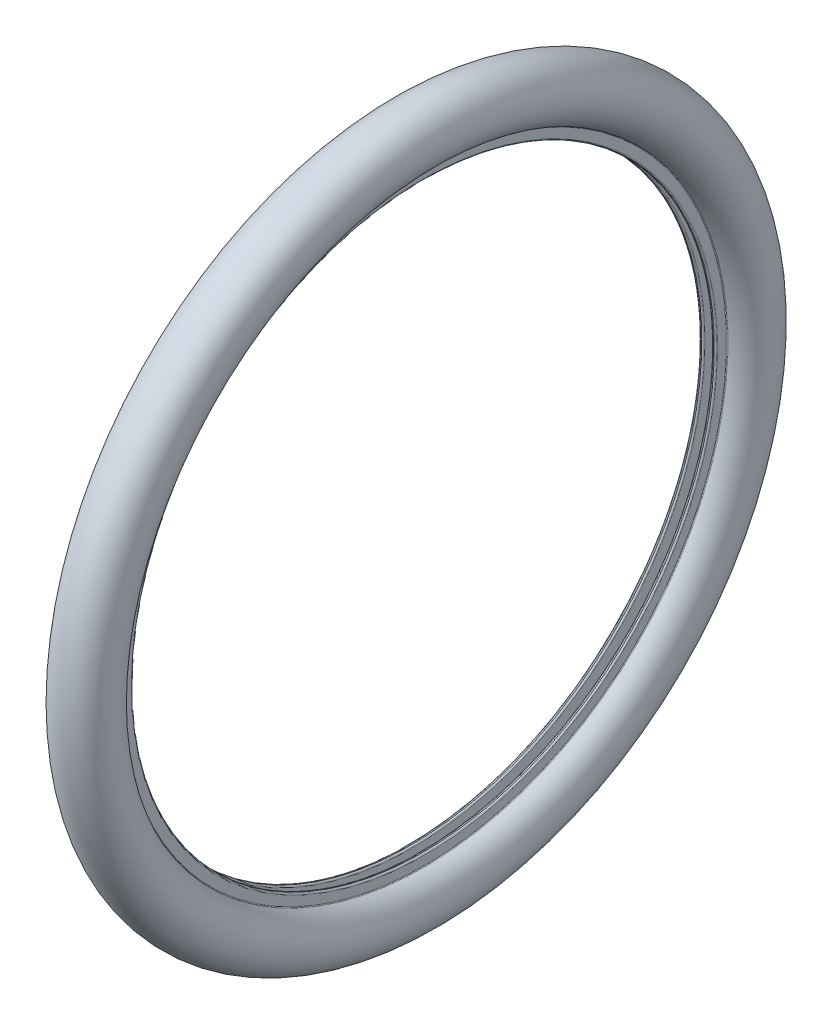
ISO-10303-21;
HEADER;
FILE_DESCRIPTION(('STEP AP214'),'2;1');
FILE_NAME('part.step','',(''),(''),'','','');
FILE_SCHEMA(('AUTOMOTIVE_DESIGN { 1 0 10303 214 1 1 1 1 }'));
ENDSEC;
DATA;
#1=APPLICATION_CONTEXT('core data for automotive mechanical design processes');
#2=APPLICATION_PROTOCOL_DEFINITION('international standard','automotive_design',2000,#1);
#3=PRODUCT_CONTEXT('',#1,'mechanical');
#4=PRODUCT('Part','Part','',(#3));
#5=PRODUCT_RELATED_PRODUCT_CATEGORY('part','',(#4));
#6=PRODUCT_DEFINITION_FORMATION('','',#4);
#7=PRODUCT_DEFINITION_CONTEXT('part definition',#1,'design');
#8=PRODUCT_DEFINITION('design','',#6,#7);
#9=PRODUCT_DEFINITION_SHAPE('','',#8);
#10=(LENGTH_UNIT() NAMED_UNIT(*) SI_UNIT(.MILLI.,.METRE.));
#11=(NAMED_UNIT(*) PLANE_ANGLE_UNIT() SI_UNIT($,.RADIAN.));
#12=(NAMED_UNIT(*) SI_UNIT($,.STERADIAN.) SOLID_ANGLE_UNIT());
#13=UNCERTAINTY_MEASURE_WITH_UNIT(LENGTH_MEASURE(1.E-05),#10,'distance_accuracy_value','');
#14=(GEOMETRIC_REPRESENTATION_CONTEXT(3) GLOBAL_UNCERTAINTY_ASSIGNED_CONTEXT((#13)) GLOBAL_UNIT_ASSIGNED_CONTEXT((#10,
#11,#12)) REPRESENTATION_CONTEXT('',''));
#15=CARTESIAN_POINT('',(0.,0.,0.));
#16=DIRECTION('',(0.,0.,1.));
#17=DIRECTION('',(1.,0.,0.));
#18=AXIS2_PLACEMENT_3D('',#15,#16,#17);
#19=CARTESIAN_POINT('',(0.,0.,0.));
#20=DIRECTION('',(-1.,0.,0.));
#21=DIRECTION('',(0.,0.,1.));
#22=AXIS2_PLACEMENT_3D('',#19,#20,#21);
#23=TOROIDAL_SURFACE('',#22,319.189528299502,19.5);
#24=CARTESIAN_POINT('',(8.,0.,0.));
#25=DIRECTION('',(-1.,0.,0.));
#26=DIRECTION('',(0.,0.,1.));
#27=AXIS2_PLACEMENT_3D('',#24,#25,#26);
#28=CIRCLE('',#27,301.406109055723);
#29=CARTESIAN_POINT('',(8.,0.,301.406109055723));
#30=VERTEX_POINT('',#29);
#31=EDGE_CURVE('E91',#30,#30,#28,.T.);
#32=ORIENTED_EDGE('',*,*,#31,.F.);
#33=EDGE_LOOP('',(#32));
#34=FACE_BOUND('',#33,.T.);
#35=CARTESIAN_POINT('',(-8.,0.,0.));
#36=DIRECTION('',(-1.,0.,0.));
#37=DIRECTION('',(0.,0.,1.));
#38=AXIS2_PLACEMENT_3D('',#35,#36,#37);
#39=CIRCLE('',#38,301.406109055723);
#40=CARTESIAN_POINT('',(-8.,0.,301.406109055723));
#41=VERTEX_POINT('',#40);
#42=EDGE_CURVE('E10',#41,#41,#39,.T.);
#43=ORIENTED_EDGE('',*,*,#42,.T.);
#44=EDGE_LOOP('',(#43));
#45=FACE_BOUND('',#44,.T.);
#46=ADVANCED_FACE('F33',(#34,#45),#23,.F.);
#47=CARTESIAN_POINT('',(-25.,0.,0.));
#48=DIRECTION('',(-1.,0.,0.));
#49=DIRECTION('',(0.,0.,1.));
#50=AXIS2_PLACEMENT_3D('',#47,#48,#49);
#51=CYLINDRICAL_SURFACE('',#50,301.406109055723);
#52=ORIENTED_EDGE('',*,*,#42,.F.);
#53=EDGE_LOOP('',(#52));
#54=FACE_BOUND('',#53,.T.);
#55=CARTESIAN_POINT('',(-7.49999999999998,0.,0.));
#56=DIRECTION('',(-1.,0.,0.));
#57=DIRECTION('',(0.,0.,1.));
#58=AXIS2_PLACEMENT_3D('',#55,#56,#57);
#59=CIRCLE('',#58,301.406109055723);
#60=CARTESIAN_POINT('',(-7.49999999999998,0.,301.406109055723));
#61=VERTEX_POINT('',#60);
#62=EDGE_CURVE('E39',#61,#61,#59,.T.);
#63=ORIENTED_EDGE('',*,*,#62,.T.);
#64=EDGE_LOOP('',(#63));
#65=FACE_BOUND('',#64,.T.);
#66=ADVANCED_FACE('F98',(#54,#65),#51,.T.);
#67=CARTESIAN_POINT('',(-7.49999999999998,0.,0.));
#68=DIRECTION('',(-1.,0.,0.));
#69=DIRECTION('',(0.,0.,1.));
#70=AXIS2_PLACEMENT_3D('',#67,#68,#69);
#71=TOROIDAL_SURFACE('',#70,297.906109055723,3.5);
#72=ORIENTED_EDGE('',*,*,#62,.F.);
#73=EDGE_LOOP('',(#72));
#74=FACE_BOUND('',#73,.T.);
#75=CARTESIAN_POINT('',(-3.99999999999998,0.,0.));
#76=DIRECTION('',(-1.,0.,0.));
#77=DIRECTION('',(0.,0.,1.));
#78=AXIS2_PLACEMENT_3D('',#75,#76,#77);
#79=CIRCLE('',#78,297.906109055723);
#80=CARTESIAN_POINT('',(-3.99999999999998,0.,297.906109055723));
#81=VERTEX_POINT('',#80);
#82=EDGE_CURVE('E43',#81,#81,#79,.T.);
#83=ORIENTED_EDGE('',*,*,#82,.T.);
#84=EDGE_LOOP('',(#83));
#85=FACE_BOUND('',#84,.T.);
#86=ADVANCED_FACE('F102',(#74,#85),#71,.T.);
#87=CARTESIAN_POINT('',(-3.99999999999998,283.5,0.));
#88=DIRECTION('',(-1.,0.,0.));
#89=DIRECTION('',(0.,0.,1.));
#90=AXIS2_PLACEMENT_3D('',#87,#88,#89);
#91=PLANE('',#90);
#92=ORIENTED_EDGE('',*,*,#82,.F.);
#93=EDGE_LOOP('',(#92));
#94=FACE_BOUND('',#93,.T.);
#95=CARTESIAN_POINT('',(-3.99999999999998,0.,0.));
#96=DIRECTION('',(-1.,0.,0.));
#97=DIRECTION('',(0.,0.,1.));
#98=AXIS2_PLACEMENT_3D('',#95,#96,#97);
#99=CIRCLE('',#98,283.5);
#100=CARTESIAN_POINT('',(-3.99999999999998,0.,283.5));
#101=VERTEX_POINT('',#100);
#102=EDGE_CURVE('E47',#101,#101,#99,.T.);
#103=ORIENTED_EDGE('',*,*,#102,.T.);
#104=EDGE_LOOP('',(#103));
#105=FACE_BOUND('',#104,.T.);
#106=ADVANCED_FACE('F107',(#94,#105),#91,.F.);
#107=CARTESIAN_POINT('',(-5.49999999999998,0.,0.));
#108=DIRECTION('',(-1.,0.,0.));
#109=DIRECTION('',(0.,0.,1.));
#110=AXIS2_PLACEMENT_3D('',#107,#108,#109);
#111=TOROIDAL_SURFACE('',#110,283.5,1.5);
#112=ORIENTED_EDGE('',*,*,#102,.F.);
#113=EDGE_LOOP('',(#112));
#114=FACE_BOUND('',#113,.T.);
#115=CARTESIAN_POINT('',(-5.49999999999998,0.,0.));
#116=DIRECTION('',(-1.,0.,0.));
#117=DIRECTION('',(0.,0.,1.));
#118=AXIS2_PLACEMENT_3D('',#115,#116,#117);
#119=CIRCLE('',#118,282.);
#120=CARTESIAN_POINT('',(-5.49999999999998,0.,282.));
#121=VERTEX_POINT('',#120);
#122=EDGE_CURVE('E52',#121,#121,#119,.T.);
#123=ORIENTED_EDGE('',*,*,#122,.T.);
#124=EDGE_LOOP('',(#123));
#125=FACE_BOUND('',#124,.T.);
#126=ADVANCED_FACE('F113',(#114,#125),#111,.T.);
#127=CARTESIAN_POINT('',(-25.,0.,0.));
#128=DIRECTION('',(-1.,0.,0.));
#129=DIRECTION('',(0.,0.,1.));
#130=AXIS2_PLACEMENT_3D('',#127,#128,#129);
#131=CYLINDRICAL_SURFACE('',#130,282.);
#132=ORIENTED_EDGE('',*,*,#122,.F.);
#133=EDGE_LOOP('',(#132));
#134=FACE_BOUND('',#133,.T.);
#135=CARTESIAN_POINT('',(-6.5,0.,0.));
#136=DIRECTION('',(-1.,0.,0.));
#137=DIRECTION('',(0.,0.,1.));
#138=AXIS2_PLACEMENT_3D('',#135,#136,#137);
#139=CIRCLE('',#138,282.);
#140=CARTESIAN_POINT('',(-6.5,0.,282.));
#141=VERTEX_POINT('',#140);
#142=EDGE_CURVE('E55',#141,#141,#139,.T.);
#143=ORIENTED_EDGE('',*,*,#142,.T.);
#144=EDGE_LOOP('',(#143));
#145=FACE_BOUND('',#144,.T.);
#146=ADVANCED_FACE('F117',(#134,#145),#131,.F.);
#147=CARTESIAN_POINT('',(-6.5,0.,0.));
#148=DIRECTION('',(-1.,0.,0.));
#149=DIRECTION('',(0.,0.,1.));
#150=AXIS2_PLACEMENT_3D('',#147,#148,#149);
#151=TOROIDAL_SURFACE('',#150,283.5,1.50000000000003);
#152=ORIENTED_EDGE('',*,*,#142,.F.);
#153=EDGE_LOOP('',(#152));
#154=FACE_BOUND('',#153,.T.);
#155=CARTESIAN_POINT('',(-8.00000000000003,0.,0.));
#156=DIRECTION('',(-1.,0.,0.));
#157=DIRECTION('',(0.,0.,1.));
#158=AXIS2_PLACEMENT_3D('',#155,#156,#157);
#159=CIRCLE('',#158,283.5);
#160=CARTESIAN_POINT('',(-8.00000000000003,0.,283.5));
#161=VERTEX_POINT('',#160);
#162=EDGE_CURVE('E58',#161,#161,#159,.T.);
#163=ORIENTED_EDGE('',*,*,#162,.T.);
#164=EDGE_LOOP('',(#163));
#165=FACE_BOUND('',#164,.T.);
#166=ADVANCED_FACE('F121',(#154,#165),#151,.T.);
#167=CARTESIAN_POINT('',(-8.00000000000001,292.218099487822,0.));
#168=DIRECTION('',(1.,0.,0.));
#169=DIRECTION('',(0.,0.,-1.));
#170=AXIS2_PLACEMENT_3D('',#167,#168,#169);
#171=PLANE('',#170);
#172=ORIENTED_EDGE('',*,*,#162,.F.);
#173=EDGE_LOOP('',(#172));
#174=FACE_BOUND('',#173,.T.);
#175=CARTESIAN_POINT('',(-8.,0.,0.));
#176=DIRECTION('',(-1.,0.,0.));
#177=DIRECTION('',(0.,0.,1.));
#178=AXIS2_PLACEMENT_3D('',#175,#176,#177);
#179=CIRCLE('',#178,292.218099487822);
#180=CARTESIAN_POINT('',(-8.,0.,292.218099487822));
#181=VERTEX_POINT('',#180);
#182=EDGE_CURVE('E61',#181,#181,#179,.T.);
#183=ORIENTED_EDGE('',*,*,#182,.T.);
#184=EDGE_LOOP('',(#183));
#185=FACE_BOUND('',#184,.T.);
#186=ADVANCED_FACE('F125',(#174,#185),#171,.F.);
#187=CARTESIAN_POINT('',(-8.90276851650059,0.,0.));
#188=DIRECTION('',(-1.,0.,0.));
#189=DIRECTION('',(0.,0.,1.));
#190=AXIS2_PLACEMENT_3D('',#187,#188,#189);
#191=TOROIDAL_SURFACE('',#190,292.218099487822,0.902768516500582);
#192=ORIENTED_EDGE('',*,*,#182,.F.);
#193=EDGE_LOOP('',(#192));
#194=FACE_BOUND('',#193,.T.);
#195=CARTESIAN_POINT('',(-8.61979824472162,0.,0.));
#196=DIRECTION('',(-1.,0.,0.));
#197=DIRECTION('',(0.,0.,1.));
#198=AXIS2_PLACEMENT_3D('',#195,#196,#197);
#199=CIRCLE('',#198,293.075373551161);
#200=CARTESIAN_POINT('',(-8.61979824472162,0.,293.075373551161));
#201=VERTEX_POINT('',#200);
#202=EDGE_CURVE('E64',#201,#201,#199,.T.);
#203=ORIENTED_EDGE('',*,*,#202,.T.);
#204=EDGE_LOOP('',(#203));
#205=FACE_BOUND('',#204,.T.);
#206=ADVANCED_FACE('F129',(#194,#205),#191,.F.);
#207=CARTESIAN_POINT('',(0.,0.,0.));
#208=DIRECTION('',(-1.,0.,0.));
#209=DIRECTION('',(0.,0.,1.));
#210=AXIS2_PLACEMENT_3D('',#207,#208,#209);
#211=TOROIDAL_SURFACE('',#210,319.189528299502,27.5);
#212=ORIENTED_EDGE('',*,*,#202,.F.);
#213=EDGE_LOOP('',(#212));
#214=FACE_BOUND('',#213,.T.);
#215=CARTESIAN_POINT('',(8.61979824472161,0.,0.));
#216=DIRECTION('',(-1.,0.,0.));
#217=DIRECTION('',(0.,0.,1.));
#218=AXIS2_PLACEMENT_3D('',#215,#216,#217);
#219=CIRCLE('',#218,293.075373551161);
#220=CARTESIAN_POINT('',(8.61979824472161,0.,293.075373551161));
#221=VERTEX_POINT('',#220);
#222=EDGE_CURVE('E67',#221,#221,#219,.T.);
#223=ORIENTED_EDGE('',*,*,#222,.T.);
#224=EDGE_LOOP('',(#223));
#225=FACE_BOUND('',#224,.T.);
#226=ADVANCED_FACE('F133',(#214,#225),#211,.T.);
#227=CARTESIAN_POINT('',(8.90276851650059,0.,0.));
#228=DIRECTION('',(-1.,0.,0.));
#229=DIRECTION('',(0.,0.,1.));
#230=AXIS2_PLACEMENT_3D('',#227,#228,#229);
#231=TOROIDAL_SURFACE('',#230,292.218099487822,0.902768516500582);
#232=ORIENTED_EDGE('',*,*,#222,.F.);
#233=EDGE_LOOP('',(#232));
#234=FACE_BOUND('',#233,.T.);
#235=CARTESIAN_POINT('',(8.00000000000001,0.,0.));
#236=DIRECTION('',(-1.,0.,0.));
#237=DIRECTION('',(0.,0.,1.));
#238=AXIS2_PLACEMENT_3D('',#235,#236,#237);
#239=CIRCLE('',#238,292.218099487822);
#240=CARTESIAN_POINT('',(8.00000000000001,0.,292.218099487822));
#241=VERTEX_POINT('',#240);
#242=EDGE_CURVE('E70',#241,#241,#239,.T.);
#243=ORIENTED_EDGE('',*,*,#242,.T.);
#244=EDGE_LOOP('',(#243));
#245=FACE_BOUND('',#244,.T.);
#246=ADVANCED_FACE('F137',(#234,#245),#231,.F.);
#247=CARTESIAN_POINT('',(8.,292.218099487822,0.));
#248=DIRECTION('',(-1.,0.,0.));
#249=DIRECTION('',(0.,0.,1.));
#250=AXIS2_PLACEMENT_3D('',#247,#248,#249);
#251=PLANE('',#250);
#252=ORIENTED_EDGE('',*,*,#242,.F.);
#253=EDGE_LOOP('',(#252));
#254=FACE_BOUND('',#253,.T.);
#255=CARTESIAN_POINT('',(8.,0.,0.));
#256=DIRECTION('',(-1.,0.,0.));
#257=DIRECTION('',(0.,0.,1.));
#258=AXIS2_PLACEMENT_3D('',#255,#256,#257);
#259=CIRCLE('',#258,283.5);
#260=CARTESIAN_POINT('',(8.,0.,283.5));
#261=VERTEX_POINT('',#260);
#262=EDGE_CURVE('E73',#261,#261,#259,.T.);
#263=ORIENTED_EDGE('',*,*,#262,.T.);
#264=EDGE_LOOP('',(#263));
#265=FACE_BOUND('',#264,.T.);
#266=ADVANCED_FACE('F141',(#254,#265),#251,.F.);
#267=CARTESIAN_POINT('',(6.5,0.,0.));
#268=DIRECTION('',(-1.,0.,0.));
#269=DIRECTION('',(0.,0.,1.));
#270=AXIS2_PLACEMENT_3D('',#267,#268,#269);
#271=TOROIDAL_SURFACE('',#270,283.5,1.5);
#272=ORIENTED_EDGE('',*,*,#262,.F.);
#273=EDGE_LOOP('',(#272));
#274=FACE_BOUND('',#273,.T.);
#275=CARTESIAN_POINT('',(6.5,0.,0.));
#276=DIRECTION('',(-1.,0.,0.));
#277=DIRECTION('',(0.,0.,1.));
#278=AXIS2_PLACEMENT_3D('',#275,#276,#277);
#279=CIRCLE('',#278,282.);
#280=CARTESIAN_POINT('',(6.5,0.,282.));
#281=VERTEX_POINT('',#280);
#282=EDGE_CURVE('E76',#281,#281,#279,.T.);
#283=ORIENTED_EDGE('',*,*,#282,.T.);
#284=EDGE_LOOP('',(#283));
#285=FACE_BOUND('',#284,.T.);
#286=ADVANCED_FACE('F145',(#274,#285),#271,.T.);
#287=CARTESIAN_POINT('',(-25.,0.,0.));
#288=DIRECTION('',(-1.,0.,0.));
#289=DIRECTION('',(0.,0.,1.));
#290=AXIS2_PLACEMENT_3D('',#287,#288,#289);
#291=CYLINDRICAL_SURFACE('',#290,282.);
#292=ORIENTED_EDGE('',*,*,#282,.F.);
#293=EDGE_LOOP('',(#292));
#294=FACE_BOUND('',#293,.T.);
#295=CARTESIAN_POINT('',(5.49999999999998,0.,0.));
#296=DIRECTION('',(-1.,0.,0.));
#297=DIRECTION('',(0.,0.,1.));
#298=AXIS2_PLACEMENT_3D('',#295,#296,#297);
#299=CIRCLE('',#298,282.);
#300=CARTESIAN_POINT('',(5.49999999999998,0.,282.));
#301=VERTEX_POINT('',#300);
#302=EDGE_CURVE('E79',#301,#301,#299,.T.);
#303=ORIENTED_EDGE('',*,*,#302,.T.);
#304=EDGE_LOOP('',(#303));
#305=FACE_BOUND('',#304,.T.);
#306=ADVANCED_FACE('F149',(#294,#305),#291,.F.);
#307=CARTESIAN_POINT('',(5.49999999999998,0.,0.));
#308=DIRECTION('',(-1.,0.,0.));
#309=DIRECTION('',(0.,0.,1.));
#310=AXIS2_PLACEMENT_3D('',#307,#308,#309);
#311=TOROIDAL_SURFACE('',#310,283.5,1.5);
#312=ORIENTED_EDGE('',*,*,#302,.F.);
#313=EDGE_LOOP('',(#312));
#314=FACE_BOUND('',#313,.T.);
#315=CARTESIAN_POINT('',(3.99999999999998,0.,0.));
#316=DIRECTION('',(-1.,0.,0.));
#317=DIRECTION('',(0.,0.,1.));
#318=AXIS2_PLACEMENT_3D('',#315,#316,#317);
#319=CIRCLE('',#318,283.5);
#320=CARTESIAN_POINT('',(3.99999999999998,0.,283.5));
#321=VERTEX_POINT('',#320);
#322=EDGE_CURVE('E82',#321,#321,#319,.T.);
#323=ORIENTED_EDGE('',*,*,#322,.T.);
#324=EDGE_LOOP('',(#323));
#325=FACE_BOUND('',#324,.T.);
#326=ADVANCED_FACE('F153',(#314,#325),#311,.T.);
#327=CARTESIAN_POINT('',(3.99999999999998,283.5,0.));
#328=DIRECTION('',(1.,0.,0.));
#329=DIRECTION('',(0.,0.,-1.));
#330=AXIS2_PLACEMENT_3D('',#327,#328,#329);
#331=PLANE('',#330);
#332=ORIENTED_EDGE('',*,*,#322,.F.);
#333=EDGE_LOOP('',(#332));
#334=FACE_BOUND('',#333,.T.);
#335=CARTESIAN_POINT('',(3.99999999999998,0.,0.));
#336=DIRECTION('',(-1.,0.,0.));
#337=DIRECTION('',(0.,0.,1.));
#338=AXIS2_PLACEMENT_3D('',#335,#336,#337);
#339=CIRCLE('',#338,297.906109055723);
#340=CARTESIAN_POINT('',(3.99999999999998,0.,297.906109055723));
#341=VERTEX_POINT('',#340);
#342=EDGE_CURVE('E85',#341,#341,#339,.T.);
#343=ORIENTED_EDGE('',*,*,#342,.T.);
#344=EDGE_LOOP('',(#343));
#345=FACE_BOUND('',#344,.T.);
#346=ADVANCED_FACE('F157',(#334,#345),#331,.F.);
#347=CARTESIAN_POINT('',(7.49999999999998,0.,0.));
#348=DIRECTION('',(-1.,0.,0.));
#349=DIRECTION('',(0.,0.,1.));
#350=AXIS2_PLACEMENT_3D('',#347,#348,#349);
#351=TOROIDAL_SURFACE('',#350,297.906109055723,3.5);
#352=ORIENTED_EDGE('',*,*,#342,.F.);
#353=EDGE_LOOP('',(#352));
#354=FACE_BOUND('',#353,.T.);
#355=CARTESIAN_POINT('',(7.49999999999998,0.,0.));
#356=DIRECTION('',(-1.,0.,0.));
#357=DIRECTION('',(0.,0.,1.));
#358=AXIS2_PLACEMENT_3D('',#355,#356,#357);
#359=CIRCLE('',#358,301.406109055723);
#360=CARTESIAN_POINT('',(7.49999999999998,0.,301.406109055723));
#361=VERTEX_POINT('',#360);
#362=EDGE_CURVE('E88',#361,#361,#359,.T.);
#363=ORIENTED_EDGE('',*,*,#362,.T.);
#364=EDGE_LOOP('',(#363));
#365=FACE_BOUND('',#364,.T.);
#366=ADVANCED_FACE('F161',(#354,#365),#351,.T.);
#367=CARTESIAN_POINT('',(-25.,0.,0.));
#368=DIRECTION('',(-1.,0.,0.));
#369=DIRECTION('',(0.,0.,1.));
#370=AXIS2_PLACEMENT_3D('',#367,#368,#369);
#371=CYLINDRICAL_SURFACE('',#370,301.406109055723);
#372=ORIENTED_EDGE('',*,*,#362,.F.);
#373=EDGE_LOOP('',(#372));
#374=FACE_BOUND('',#373,.T.);
#375=ORIENTED_EDGE('',*,*,#31,.T.);
#376=EDGE_LOOP('',(#375));
#377=FACE_BOUND('',#376,.T.);
#378=ADVANCED_FACE('F95',(#374,#377),#371,.T.);
#379=CLOSED_SHELL('',(#46,#66,#86,#106,#126,#146,#166,#186,#206,#226,#246,#266,#286,#306,#326,
#346,#366,#378));
#380=MANIFOLD_SOLID_BREP('B2',#379);
#381=ADVANCED_BREP_SHAPE_REPRESENTATION('',(#18,#380),#14);
#382=SHAPE_DEFINITION_REPRESENTATION(#9,#381);
ENDSEC;
END-ISO-10303-21;
